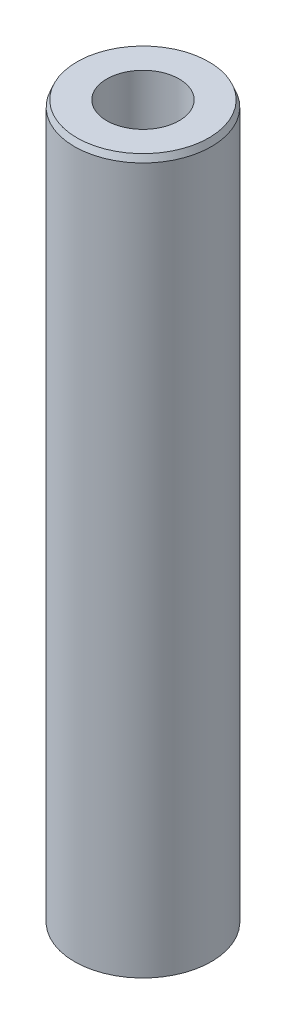
ISO-10303-21;
HEADER;
FILE_DESCRIPTION(('STEP AP214'),'2;1');
FILE_NAME('part.step','',(''),(''),'','','');
FILE_SCHEMA(('AUTOMOTIVE_DESIGN { 1 0 10303 214 1 1 1 1 }'));
ENDSEC;
DATA;
#1=APPLICATION_CONTEXT('core data for automotive mechanical design processes');
#2=APPLICATION_PROTOCOL_DEFINITION('international standard','automotive_design',2000,#1);
#3=PRODUCT_CONTEXT('',#1,'mechanical');
#4=PRODUCT('Part','Part','',(#3));
#5=PRODUCT_RELATED_PRODUCT_CATEGORY('part','',(#4));
#6=PRODUCT_DEFINITION_FORMATION('','',#4);
#7=PRODUCT_DEFINITION_CONTEXT('part definition',#1,'design');
#8=PRODUCT_DEFINITION('design','',#6,#7);
#9=PRODUCT_DEFINITION_SHAPE('','',#8);
#10=(LENGTH_UNIT() NAMED_UNIT(*) SI_UNIT(.MILLI.,.METRE.));
#11=(NAMED_UNIT(*) PLANE_ANGLE_UNIT() SI_UNIT($,.RADIAN.));
#12=(NAMED_UNIT(*) SI_UNIT($,.STERADIAN.) SOLID_ANGLE_UNIT());
#13=UNCERTAINTY_MEASURE_WITH_UNIT(LENGTH_MEASURE(1.E-05),#10,'distance_accuracy_value','');
#14=(GEOMETRIC_REPRESENTATION_CONTEXT(3) GLOBAL_UNCERTAINTY_ASSIGNED_CONTEXT((#13)) GLOBAL_UNIT_ASSIGNED_CONTEXT((#10,
#11,#12)) REPRESENTATION_CONTEXT('',''));
#15=CARTESIAN_POINT('',(0.,0.,0.));
#16=DIRECTION('',(0.,0.,1.));
#17=DIRECTION('',(1.,0.,0.));
#18=AXIS2_PLACEMENT_3D('',#15,#16,#17);
#19=CARTESIAN_POINT('',(0.,600.,0.));
#20=DIRECTION('',(0.,-1.,0.));
#21=DIRECTION('',(0.,0.,-1.));
#22=AXIS2_PLACEMENT_3D('',#19,#20,#21);
#23=CYLINDRICAL_SURFACE('',#22,57.5);
#24=CARTESIAN_POINT('',(0.,594.711029987945,0.));
#25=DIRECTION('',(0.,1.,0.));
#26=DIRECTION('',(0.,0.,1.));
#27=AXIS2_PLACEMENT_3D('',#24,#25,#26);
#28=CIRCLE('',#27,57.5);
#29=CARTESIAN_POINT('',(0.,594.711029987945,57.5));
#30=VERTEX_POINT('',#29);
#31=EDGE_CURVE('E50',#30,#30,#28,.F.);
#32=ORIENTED_EDGE('',*,*,#31,.T.);
#33=EDGE_LOOP('',(#32));
#34=FACE_BOUND('',#33,.T.);
#35=CARTESIAN_POINT('',(0.,2.1512611210629,0.));
#36=DIRECTION('',(0.,1.,0.));
#37=DIRECTION('',(0.,0.,1.));
#38=AXIS2_PLACEMENT_3D('',#35,#36,#37);
#39=CIRCLE('',#38,57.5);
#40=CARTESIAN_POINT('',(0.,2.1512611210629,57.5));
#41=VERTEX_POINT('',#40);
#42=EDGE_CURVE('E51',#41,#41,#39,.T.);
#43=ORIENTED_EDGE('',*,*,#42,.T.);
#44=EDGE_LOOP('',(#43));
#45=FACE_BOUND('',#44,.T.);
#46=ADVANCED_FACE('F39',(#34,#45),#23,.T.);
#47=CARTESIAN_POINT('',(0.,600.,0.));
#48=DIRECTION('',(0.,1.,0.));
#49=DIRECTION('',(0.,0.,1.));
#50=AXIS2_PLACEMENT_3D('',#47,#48,#49);
#51=PLANE('',#50);
#52=CARTESIAN_POINT('',(0.,600.,0.));
#53=DIRECTION('',(0.,1.,0.));
#54=DIRECTION('',(0.,0.,1.));
#55=AXIS2_PLACEMENT_3D('',#52,#53,#54);
#56=CIRCLE('',#55,55.3487388789371);
#57=CARTESIAN_POINT('',(0.,600.,55.3487388789371));
#58=VERTEX_POINT('',#57);
#59=EDGE_CURVE('E54',#58,#58,#56,.T.);
#60=ORIENTED_EDGE('',*,*,#59,.T.);
#61=EDGE_LOOP('',(#60));
#62=FACE_BOUND('',#61,.T.);
#63=CARTESIAN_POINT('',(0.,600.,0.));
#64=DIRECTION('',(0.,1.,0.));
#65=DIRECTION('',(0.,0.,1.));
#66=AXIS2_PLACEMENT_3D('',#63,#64,#65);
#67=CIRCLE('',#66,30.4093680407694);
#68=CARTESIAN_POINT('',(0.,600.,30.4093680407694));
#69=VERTEX_POINT('',#68);
#70=EDGE_CURVE('E58',#69,#69,#67,.T.);
#71=ORIENTED_EDGE('',*,*,#70,.F.);
#72=EDGE_LOOP('',(#71));
#73=FACE_BOUND('',#72,.T.);
#74=ADVANCED_FACE('F69',(#62,#73),#51,.T.);
#75=CARTESIAN_POINT('',(0.,0.,0.));
#76=DIRECTION('',(0.,1.,0.));
#77=DIRECTION('',(0.,0.,1.));
#78=AXIS2_PLACEMENT_3D('',#75,#76,#77);
#79=PLANE('',#78);
#80=CARTESIAN_POINT('',(0.,0.,0.));
#81=DIRECTION('',(0.,1.,0.));
#82=DIRECTION('',(0.,0.,1.));
#83=AXIS2_PLACEMENT_3D('',#80,#81,#82);
#84=CIRCLE('',#83,52.2110299879455);
#85=CARTESIAN_POINT('',(0.,0.,52.2110299879455));
#86=VERTEX_POINT('',#85);
#87=EDGE_CURVE('E10',#86,#86,#84,.F.);
#88=ORIENTED_EDGE('',*,*,#87,.T.);
#89=EDGE_LOOP('',(#88));
#90=FACE_BOUND('',#89,.T.);
#91=CARTESIAN_POINT('',(0.,0.,0.));
#92=DIRECTION('',(0.,1.,0.));
#93=DIRECTION('',(0.,0.,1.));
#94=AXIS2_PLACEMENT_3D('',#91,#92,#93);
#95=CIRCLE('',#94,30.4093680407694);
#96=CARTESIAN_POINT('',(0.,0.,30.4093680407694));
#97=VERTEX_POINT('',#96);
#98=EDGE_CURVE('E63',#97,#97,#95,.T.);
#99=ORIENTED_EDGE('',*,*,#98,.T.);
#100=EDGE_LOOP('',(#99));
#101=FACE_BOUND('',#100,.T.);
#102=ADVANCED_FACE('F75',(#90,#101),#79,.F.);
#103=CARTESIAN_POINT('',(0.,600.,0.));
#104=DIRECTION('',(0.,-1.,0.));
#105=DIRECTION('',(0.,0.,-1.));
#106=AXIS2_PLACEMENT_3D('',#103,#104,#105);
#107=CYLINDRICAL_SURFACE('',#106,30.4093680407694);
#108=ORIENTED_EDGE('',*,*,#70,.T.);
#109=EDGE_LOOP('',(#108));
#110=FACE_BOUND('',#109,.T.);
#111=ORIENTED_EDGE('',*,*,#98,.F.);
#112=EDGE_LOOP('',(#111));
#113=FACE_BOUND('',#112,.T.);
#114=ADVANCED_FACE('F70',(#110,#113),#107,.F.);
#115=CARTESIAN_POINT('',(0.,600.,0.));
#116=DIRECTION('',(0.,-1.,0.));
#117=DIRECTION('',(0.,0.,-1.));
#118=AXIS2_PLACEMENT_3D('',#115,#116,#117);
#119=CONICAL_SURFACE('',#118,55.3487388789371,0.386307314464903);
#120=ORIENTED_EDGE('',*,*,#31,.F.);
#121=EDGE_LOOP('',(#120));
#122=FACE_BOUND('',#121,.T.);
#123=ORIENTED_EDGE('',*,*,#59,.F.);
#124=EDGE_LOOP('',(#123));
#125=FACE_BOUND('',#124,.T.);
#126=ADVANCED_FACE('F81',(#122,#125),#119,.T.);
#127=CARTESIAN_POINT('',(0.,2.1512611210629,0.));
#128=DIRECTION('',(0.,1.,0.));
#129=DIRECTION('',(0.,0.,1.));
#130=AXIS2_PLACEMENT_3D('',#127,#128,#129);
#131=CONICAL_SURFACE('',#130,57.5,1.18448901232998);
#132=ORIENTED_EDGE('',*,*,#87,.F.);
#133=EDGE_LOOP('',(#132));
#134=FACE_BOUND('',#133,.T.);
#135=ORIENTED_EDGE('',*,*,#42,.F.);
#136=EDGE_LOOP('',(#135));
#137=FACE_BOUND('',#136,.T.);
#138=ADVANCED_FACE('F45',(#134,#137),#131,.T.);
#139=CLOSED_SHELL('',(#46,#74,#102,#114,#126,#138));
#140=MANIFOLD_SOLID_BREP('B2',#139);
#141=ADVANCED_BREP_SHAPE_REPRESENTATION('',(#18,#140),#14);
#142=SHAPE_DEFINITION_REPRESENTATION(#9,#141);
ENDSEC;
END-ISO-10303-21;
